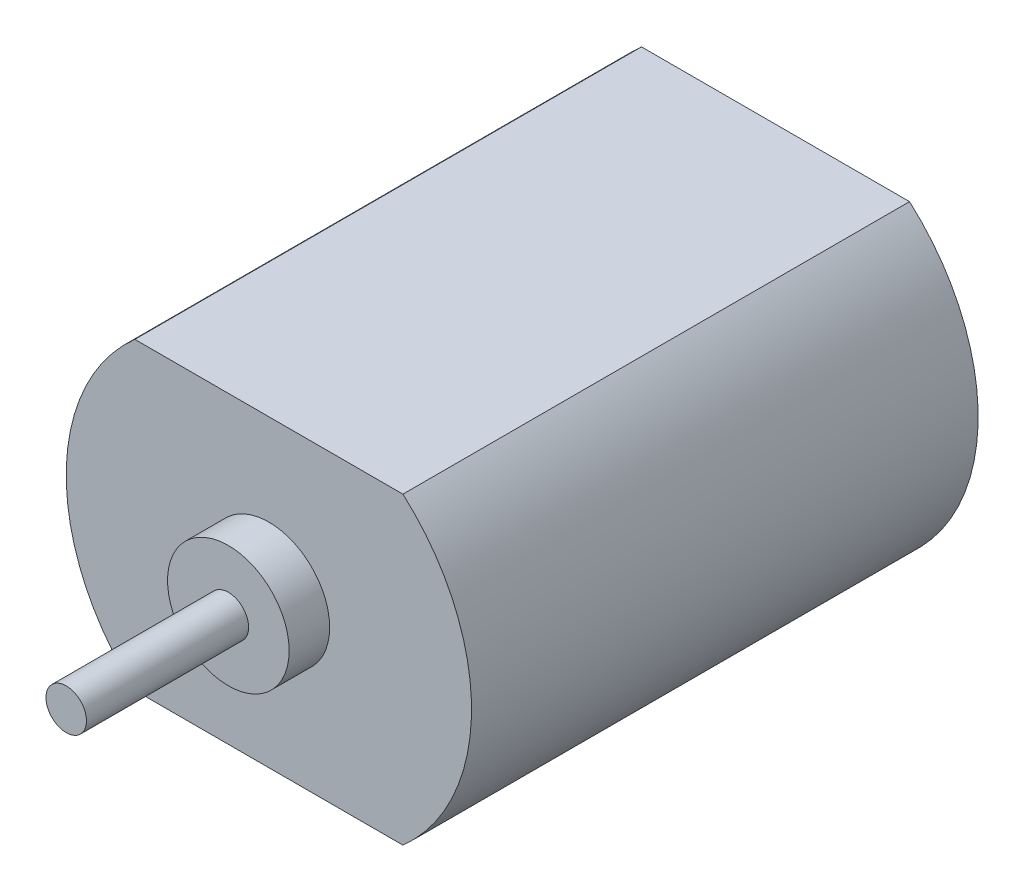
ISO-10303-21;
HEADER;
FILE_DESCRIPTION(('STEP AP214'),'2;1');
FILE_NAME('part.step','',(''),(''),'','','');
FILE_SCHEMA(('AUTOMOTIVE_DESIGN { 1 0 10303 214 1 1 1 1 }'));
ENDSEC;
DATA;
#1=APPLICATION_CONTEXT('core data for automotive mechanical design processes');
#2=APPLICATION_PROTOCOL_DEFINITION('international standard','automotive_design',2000,#1);
#3=PRODUCT_CONTEXT('',#1,'mechanical');
#4=PRODUCT('Part','Part','',(#3));
#5=PRODUCT_RELATED_PRODUCT_CATEGORY('part','',(#4));
#6=PRODUCT_DEFINITION_FORMATION('','',#4);
#7=PRODUCT_DEFINITION_CONTEXT('part definition',#1,'design');
#8=PRODUCT_DEFINITION('design','',#6,#7);
#9=PRODUCT_DEFINITION_SHAPE('','',#8);
#10=(LENGTH_UNIT() NAMED_UNIT(*) SI_UNIT(.MILLI.,.METRE.));
#11=(NAMED_UNIT(*) PLANE_ANGLE_UNIT() SI_UNIT($,.RADIAN.));
#12=(NAMED_UNIT(*) SI_UNIT($,.STERADIAN.) SOLID_ANGLE_UNIT());
#13=UNCERTAINTY_MEASURE_WITH_UNIT(LENGTH_MEASURE(1.E-05),#10,'distance_accuracy_value','');
#14=(GEOMETRIC_REPRESENTATION_CONTEXT(3) GLOBAL_UNCERTAINTY_ASSIGNED_CONTEXT((#13)) GLOBAL_UNIT_ASSIGNED_CONTEXT((#10,
#11,#12)) REPRESENTATION_CONTEXT('',''));
#15=CARTESIAN_POINT('',(0.,0.,0.));
#16=DIRECTION('',(0.,0.,1.));
#17=DIRECTION('',(1.,0.,0.));
#18=AXIS2_PLACEMENT_3D('',#15,#16,#17);
#19=CARTESIAN_POINT('',(0.,0.,25.));
#20=DIRECTION('',(0.,0.,-1.));
#21=DIRECTION('',(-1.,0.,0.));
#22=AXIS2_PLACEMENT_3D('',#19,#20,#21);
#23=CYLINDRICAL_SURFACE('',#22,10.);
#24=CARTESIAN_POINT('',(0.,0.,0.));
#25=DIRECTION('',(0.,0.,1.));
#26=DIRECTION('',(1.,0.,0.));
#27=AXIS2_PLACEMENT_3D('',#24,#25,#26);
#28=CIRCLE('',#27,10.);
#29=CARTESIAN_POINT('',(-6.61437827766148,7.5,0.));
#30=VERTEX_POINT('',#29);
#31=CARTESIAN_POINT('',(-6.61437827766148,-7.5,0.));
#32=VERTEX_POINT('',#31);
#33=EDGE_CURVE('E99',#30,#32,#28,.T.);
#34=ORIENTED_EDGE('',*,*,#33,.T.);
#35=DIRECTION('',(0.,0.,-1.));
#36=VECTOR('',#35,1.);
#37=CARTESIAN_POINT('',(-6.61437827766148,-7.5,25.));
#38=LINE('',#37,#36);
#39=CARTESIAN_POINT('',(-6.61437827766148,-7.5,25.));
#40=VERTEX_POINT('',#39);
#41=EDGE_CURVE('E35',#40,#32,#38,.T.);
#42=ORIENTED_EDGE('',*,*,#41,.F.);
#43=CARTESIAN_POINT('',(0.,0.,25.));
#44=DIRECTION('',(0.,0.,1.));
#45=DIRECTION('',(1.,0.,0.));
#46=AXIS2_PLACEMENT_3D('',#43,#44,#45);
#47=CIRCLE('',#46,10.);
#48=CARTESIAN_POINT('',(-6.61437827766148,7.5,25.));
#49=VERTEX_POINT('',#48);
#50=EDGE_CURVE('E86',#49,#40,#47,.T.);
#51=ORIENTED_EDGE('',*,*,#50,.F.);
#52=DIRECTION('',(0.,0.,-1.));
#53=VECTOR('',#52,1.);
#54=CARTESIAN_POINT('',(-6.61437827766148,7.5,25.));
#55=LINE('',#54,#53);
#56=EDGE_CURVE('E95',#49,#30,#55,.T.);
#57=ORIENTED_EDGE('',*,*,#56,.T.);
#58=EDGE_LOOP('',(#34,#42,#51,#57));
#59=FACE_BOUND('',#58,.T.);
#60=ADVANCED_FACE('F32',(#59),#23,.T.);
#61=CARTESIAN_POINT('',(-6.61437827766148,-7.5,25.));
#62=DIRECTION('',(0.,1.,0.));
#63=DIRECTION('',(0.,0.,1.));
#64=AXIS2_PLACEMENT_3D('',#61,#62,#63);
#65=PLANE('',#64);
#66=DIRECTION('',(1.,0.,0.));
#67=VECTOR('',#66,1.);
#68=CARTESIAN_POINT('',(-6.61437827766148,-7.5,0.));
#69=LINE('',#68,#67);
#70=CARTESIAN_POINT('',(6.61437827766148,-7.5,0.));
#71=VERTEX_POINT('',#70);
#72=EDGE_CURVE('E91',#32,#71,#69,.T.);
#73=ORIENTED_EDGE('',*,*,#72,.T.);
#74=DIRECTION('',(0.,0.,-1.));
#75=VECTOR('',#74,1.);
#76=CARTESIAN_POINT('',(6.61437827766148,-7.5,25.));
#77=LINE('',#76,#75);
#78=CARTESIAN_POINT('',(6.61437827766148,-7.5,25.));
#79=VERTEX_POINT('',#78);
#80=EDGE_CURVE('E89',#79,#71,#77,.T.);
#81=ORIENTED_EDGE('',*,*,#80,.F.);
#82=DIRECTION('',(1.,0.,0.));
#83=VECTOR('',#82,1.);
#84=CARTESIAN_POINT('',(-6.61437827766148,-7.5,25.));
#85=LINE('',#84,#83);
#86=EDGE_CURVE('E81',#40,#79,#85,.T.);
#87=ORIENTED_EDGE('',*,*,#86,.F.);
#88=ORIENTED_EDGE('',*,*,#41,.T.);
#89=EDGE_LOOP('',(#73,#81,#87,#88));
#90=FACE_BOUND('',#89,.T.);
#91=ADVANCED_FACE('F90',(#90),#65,.F.);
#92=CARTESIAN_POINT('',(0.,0.,25.));
#93=DIRECTION('',(0.,0.,-1.));
#94=DIRECTION('',(-1.,0.,0.));
#95=AXIS2_PLACEMENT_3D('',#92,#93,#94);
#96=CYLINDRICAL_SURFACE('',#95,10.);
#97=CARTESIAN_POINT('',(0.,0.,0.));
#98=DIRECTION('',(0.,0.,1.));
#99=DIRECTION('',(1.,0.,0.));
#100=AXIS2_PLACEMENT_3D('',#97,#98,#99);
#101=CIRCLE('',#100,10.);
#102=CARTESIAN_POINT('',(6.61437827766148,7.5,0.));
#103=VERTEX_POINT('',#102);
#104=EDGE_CURVE('E67',#71,#103,#101,.T.);
#105=ORIENTED_EDGE('',*,*,#104,.T.);
#106=DIRECTION('',(0.,0.,-1.));
#107=VECTOR('',#106,1.);
#108=CARTESIAN_POINT('',(6.61437827766148,7.5,25.));
#109=LINE('',#108,#107);
#110=CARTESIAN_POINT('',(6.61437827766148,7.5,25.));
#111=VERTEX_POINT('',#110);
#112=EDGE_CURVE('E92',#111,#103,#109,.T.);
#113=ORIENTED_EDGE('',*,*,#112,.F.);
#114=CARTESIAN_POINT('',(0.,0.,25.));
#115=DIRECTION('',(0.,0.,1.));
#116=DIRECTION('',(1.,0.,0.));
#117=AXIS2_PLACEMENT_3D('',#114,#115,#116);
#118=CIRCLE('',#117,10.);
#119=EDGE_CURVE('E84',#79,#111,#118,.T.);
#120=ORIENTED_EDGE('',*,*,#119,.F.);
#121=ORIENTED_EDGE('',*,*,#80,.T.);
#122=EDGE_LOOP('',(#105,#113,#120,#121));
#123=FACE_BOUND('',#122,.T.);
#124=ADVANCED_FACE('F93',(#123),#96,.T.);
#125=CARTESIAN_POINT('',(-6.61437827766148,7.5,25.));
#126=DIRECTION('',(0.,-1.,0.));
#127=DIRECTION('',(0.,0.,-1.));
#128=AXIS2_PLACEMENT_3D('',#125,#126,#127);
#129=PLANE('',#128);
#130=DIRECTION('',(-1.,0.,0.));
#131=VECTOR('',#130,1.);
#132=CARTESIAN_POINT('',(-6.61437827766148,7.5,0.));
#133=LINE('',#132,#131);
#134=EDGE_CURVE('E73',#103,#30,#133,.T.);
#135=ORIENTED_EDGE('',*,*,#134,.T.);
#136=ORIENTED_EDGE('',*,*,#56,.F.);
#137=DIRECTION('',(-1.,0.,0.));
#138=VECTOR('',#137,1.);
#139=CARTESIAN_POINT('',(-6.61437827766148,7.5,25.));
#140=LINE('',#139,#138);
#141=EDGE_CURVE('E50',#111,#49,#140,.T.);
#142=ORIENTED_EDGE('',*,*,#141,.F.);
#143=ORIENTED_EDGE('',*,*,#112,.T.);
#144=EDGE_LOOP('',(#135,#136,#142,#143));
#145=FACE_BOUND('',#144,.T.);
#146=ADVANCED_FACE('F107',(#145),#129,.F.);
#147=CARTESIAN_POINT('',(0.,0.,25.));
#148=DIRECTION('',(0.,0.,1.));
#149=DIRECTION('',(1.,0.,0.));
#150=AXIS2_PLACEMENT_3D('',#147,#148,#149);
#151=PLANE('',#150);
#152=CARTESIAN_POINT('',(0.,0.,25.));
#153=DIRECTION('',(0.,0.,1.));
#154=DIRECTION('',(1.,0.,0.));
#155=AXIS2_PLACEMENT_3D('',#152,#153,#154);
#156=CIRCLE('',#155,3.);
#157=CARTESIAN_POINT('',(3.,0.,25.));
#158=VERTEX_POINT('',#157);
#159=EDGE_CURVE('E41',#158,#158,#156,.T.);
#160=ORIENTED_EDGE('',*,*,#159,.F.);
#161=EDGE_LOOP('',(#160));
#162=FACE_BOUND('',#161,.T.);
#163=ORIENTED_EDGE('',*,*,#50,.T.);
#164=ORIENTED_EDGE('',*,*,#86,.T.);
#165=ORIENTED_EDGE('',*,*,#119,.T.);
#166=ORIENTED_EDGE('',*,*,#141,.T.);
#167=EDGE_LOOP('',(#163,#164,#165,#166));
#168=FACE_BOUND('',#167,.T.);
#169=ADVANCED_FACE('F82',(#162,#168),#151,.T.);
#170=CARTESIAN_POINT('',(0.,0.,0.));
#171=DIRECTION('',(0.,0.,1.));
#172=DIRECTION('',(1.,0.,0.));
#173=AXIS2_PLACEMENT_3D('',#170,#171,#172);
#174=PLANE('',#173);
#175=ORIENTED_EDGE('',*,*,#33,.F.);
#176=ORIENTED_EDGE('',*,*,#134,.F.);
#177=ORIENTED_EDGE('',*,*,#104,.F.);
#178=ORIENTED_EDGE('',*,*,#72,.F.);
#179=EDGE_LOOP('',(#175,#176,#177,#178));
#180=FACE_BOUND('',#179,.T.);
#181=ADVANCED_FACE('F110',(#180),#174,.F.);
#182=CARTESIAN_POINT('',(0.,0.,27.));
#183=DIRECTION('',(0.,0.,-1.));
#184=DIRECTION('',(-1.,0.,0.));
#185=AXIS2_PLACEMENT_3D('',#182,#183,#184);
#186=CYLINDRICAL_SURFACE('',#185,3.);
#187=CARTESIAN_POINT('',(0.,0.,27.));
#188=DIRECTION('',(0.,0.,1.));
#189=DIRECTION('',(1.,0.,0.));
#190=AXIS2_PLACEMENT_3D('',#187,#188,#189);
#191=CIRCLE('',#190,3.);
#192=CARTESIAN_POINT('',(3.,0.,27.));
#193=VERTEX_POINT('',#192);
#194=EDGE_CURVE('E102',#193,#193,#191,.T.);
#195=ORIENTED_EDGE('',*,*,#194,.F.);
#196=EDGE_LOOP('',(#195));
#197=FACE_BOUND('',#196,.T.);
#198=ORIENTED_EDGE('',*,*,#159,.T.);
#199=EDGE_LOOP('',(#198));
#200=FACE_BOUND('',#199,.T.);
#201=ADVANCED_FACE('F132',(#197,#200),#186,.T.);
#202=CARTESIAN_POINT('',(0.,0.,27.));
#203=DIRECTION('',(0.,0.,1.));
#204=DIRECTION('',(1.,0.,0.));
#205=AXIS2_PLACEMENT_3D('',#202,#203,#204);
#206=PLANE('',#205);
#207=CARTESIAN_POINT('',(0.,0.,27.));
#208=DIRECTION('',(0.,0.,1.));
#209=DIRECTION('',(1.,0.,0.));
#210=AXIS2_PLACEMENT_3D('',#207,#208,#209);
#211=CIRCLE('',#210,1.);
#212=CARTESIAN_POINT('',(1.,0.,27.));
#213=VERTEX_POINT('',#212);
#214=EDGE_CURVE('E11',#213,#213,#211,.T.);
#215=ORIENTED_EDGE('',*,*,#214,.F.);
#216=EDGE_LOOP('',(#215));
#217=FACE_BOUND('',#216,.T.);
#218=ORIENTED_EDGE('',*,*,#194,.T.);
#219=EDGE_LOOP('',(#218));
#220=FACE_BOUND('',#219,.T.);
#221=ADVANCED_FACE('F126',(#217,#220),#206,.T.);
#222=CARTESIAN_POINT('',(0.,0.,35.));
#223=DIRECTION('',(0.,0.,-1.));
#224=DIRECTION('',(-1.,0.,0.));
#225=AXIS2_PLACEMENT_3D('',#222,#223,#224);
#226=CYLINDRICAL_SURFACE('',#225,1.);
#227=CARTESIAN_POINT('',(0.,0.,35.));
#228=DIRECTION('',(0.,0.,1.));
#229=DIRECTION('',(1.,0.,0.));
#230=AXIS2_PLACEMENT_3D('',#227,#228,#229);
#231=CIRCLE('',#230,1.);
#232=CARTESIAN_POINT('',(1.,0.,35.));
#233=VERTEX_POINT('',#232);
#234=EDGE_CURVE('E116',#233,#233,#231,.T.);
#235=ORIENTED_EDGE('',*,*,#234,.F.);
#236=EDGE_LOOP('',(#235));
#237=FACE_BOUND('',#236,.T.);
#238=ORIENTED_EDGE('',*,*,#214,.T.);
#239=EDGE_LOOP('',(#238));
#240=FACE_BOUND('',#239,.T.);
#241=ADVANCED_FACE('F123',(#237,#240),#226,.T.);
#242=CARTESIAN_POINT('',(0.,0.,35.));
#243=DIRECTION('',(0.,0.,1.));
#244=DIRECTION('',(1.,0.,0.));
#245=AXIS2_PLACEMENT_3D('',#242,#243,#244);
#246=PLANE('',#245);
#247=ORIENTED_EDGE('',*,*,#234,.T.);
#248=EDGE_LOOP('',(#247));
#249=FACE_BOUND('',#248,.T.);
#250=ADVANCED_FACE('F121',(#249),#246,.T.);
#251=CLOSED_SHELL('',(#60,#91,#124,#146,#169,#181,#201,#221,#241,#250));
#252=MANIFOLD_SOLID_BREP('B2',#251);
#253=ADVANCED_BREP_SHAPE_REPRESENTATION('',(#18,#252),#14);
#254=SHAPE_DEFINITION_REPRESENTATION(#9,#253);
ENDSEC;
END-ISO-10303-21;
